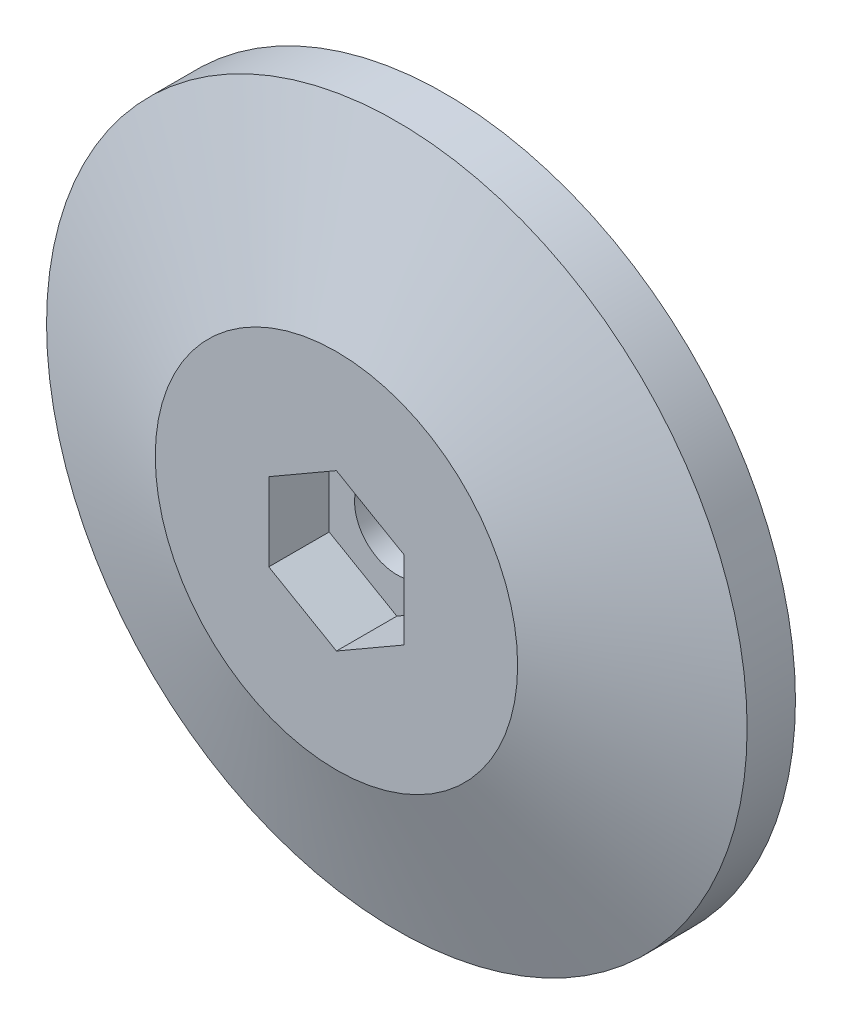
ISO-10303-21;
HEADER;
FILE_DESCRIPTION(('STEP AP214'),'2;1');
FILE_NAME('part.step','',(''),(''),'','','');
FILE_SCHEMA(('AUTOMOTIVE_DESIGN { 1 0 10303 214 1 1 1 1 }'));
ENDSEC;
DATA;
#1=APPLICATION_CONTEXT('core data for automotive mechanical design processes');
#2=APPLICATION_PROTOCOL_DEFINITION('international standard','automotive_design',2000,#1);
#3=PRODUCT_CONTEXT('',#1,'mechanical');
#4=PRODUCT('Part','Part','',(#3));
#5=PRODUCT_RELATED_PRODUCT_CATEGORY('part','',(#4));
#6=PRODUCT_DEFINITION_FORMATION('','',#4);
#7=PRODUCT_DEFINITION_CONTEXT('part definition',#1,'design');
#8=PRODUCT_DEFINITION('design','',#6,#7);
#9=PRODUCT_DEFINITION_SHAPE('','',#8);
#10=(LENGTH_UNIT() NAMED_UNIT(*) SI_UNIT(.MILLI.,.METRE.));
#11=(NAMED_UNIT(*) PLANE_ANGLE_UNIT() SI_UNIT($,.RADIAN.));
#12=(NAMED_UNIT(*) SI_UNIT($,.STERADIAN.) SOLID_ANGLE_UNIT());
#13=UNCERTAINTY_MEASURE_WITH_UNIT(LENGTH_MEASURE(1.E-05),#10,'distance_accuracy_value','');
#14=(GEOMETRIC_REPRESENTATION_CONTEXT(3) GLOBAL_UNCERTAINTY_ASSIGNED_CONTEXT((#13)) GLOBAL_UNIT_ASSIGNED_CONTEXT((#10,
#11,#12)) REPRESENTATION_CONTEXT('',''));
#15=CARTESIAN_POINT('',(0.,0.,0.));
#16=DIRECTION('',(0.,0.,1.));
#17=DIRECTION('',(1.,0.,0.));
#18=AXIS2_PLACEMENT_3D('',#15,#16,#17);
#19=CARTESIAN_POINT('',(0.,0.,2.));
#20=DIRECTION('',(0.,0.,-1.));
#21=DIRECTION('',(-1.,0.,0.));
#22=AXIS2_PLACEMENT_3D('',#19,#20,#21);
#23=CYLINDRICAL_SURFACE('',#22,14.5);
#24=CARTESIAN_POINT('',(0.,0.,2.));
#25=DIRECTION('',(0.,0.,-1.));
#26=DIRECTION('',(-1.,0.,0.));
#27=AXIS2_PLACEMENT_3D('',#24,#25,#26);
#28=CIRCLE('',#27,14.5);
#29=CARTESIAN_POINT('',(-14.5,0.,2.));
#30=VERTEX_POINT('',#29);
#31=EDGE_CURVE('E12',#30,#30,#28,.F.);
#32=ORIENTED_EDGE('',*,*,#31,.F.);
#33=EDGE_LOOP('',(#32));
#34=FACE_BOUND('',#33,.T.);
#35=CARTESIAN_POINT('',(0.,0.,0.));
#36=DIRECTION('',(0.,0.,1.));
#37=DIRECTION('',(1.,0.,0.));
#38=AXIS2_PLACEMENT_3D('',#35,#36,#37);
#39=CIRCLE('',#38,14.5);
#40=CARTESIAN_POINT('',(14.5,0.,0.));
#41=VERTEX_POINT('',#40);
#42=EDGE_CURVE('E45',#41,#41,#39,.T.);
#43=ORIENTED_EDGE('',*,*,#42,.T.);
#44=EDGE_LOOP('',(#43));
#45=FACE_BOUND('',#44,.T.);
#46=ADVANCED_FACE('F37',(#34,#45),#23,.T.);
#47=CARTESIAN_POINT('',(0.,0.,0.));
#48=DIRECTION('',(0.,0.,1.));
#49=DIRECTION('',(1.,0.,0.));
#50=AXIS2_PLACEMENT_3D('',#47,#48,#49);
#51=PLANE('',#50);
#52=CARTESIAN_POINT('',(0.,0.,0.));
#53=DIRECTION('',(0.,0.,1.));
#54=DIRECTION('',(1.,0.,0.));
#55=AXIS2_PLACEMENT_3D('',#52,#53,#54);
#56=CIRCLE('',#55,1.75);
#57=CARTESIAN_POINT('',(1.75,0.,0.));
#58=VERTEX_POINT('',#57);
#59=EDGE_CURVE('E181',#58,#58,#56,.T.);
#60=ORIENTED_EDGE('',*,*,#59,.T.);
#61=EDGE_LOOP('',(#60));
#62=FACE_BOUND('',#61,.T.);
#63=ORIENTED_EDGE('',*,*,#42,.F.);
#64=EDGE_LOOP('',(#63));
#65=FACE_BOUND('',#64,.T.);
#66=ADVANCED_FACE('F169',(#62,#65),#51,.F.);
#67=CARTESIAN_POINT('',(0.,0.,4.5));
#68=DIRECTION('',(0.,0.,1.));
#69=DIRECTION('',(1.,0.,0.));
#70=AXIS2_PLACEMENT_3D('',#67,#68,#69);
#71=PLANE('',#70);
#72=DIRECTION('',(0.866025403784439,0.5,0.));
#73=VECTOR('',#72,1.);
#74=CARTESIAN_POINT('',(0.,-3.2331615074619,4.5));
#75=LINE('',#74,#73);
#76=CARTESIAN_POINT('',(0.,-3.2331615074619,4.5));
#77=VERTEX_POINT('',#76);
#78=CARTESIAN_POINT('',(2.8,-1.61658075373095,4.5));
#79=VERTEX_POINT('',#78);
#80=EDGE_CURVE('E53',#77,#79,#75,.T.);
#81=ORIENTED_EDGE('',*,*,#80,.F.);
#82=DIRECTION('',(0.866025403784439,-0.5,0.));
#83=VECTOR('',#82,1.);
#84=CARTESIAN_POINT('',(-2.8,-1.61658075373095,4.5));
#85=LINE('',#84,#83);
#86=CARTESIAN_POINT('',(-2.8,-1.61658075373095,4.5));
#87=VERTEX_POINT('',#86);
#88=EDGE_CURVE('E136',#87,#77,#85,.T.);
#89=ORIENTED_EDGE('',*,*,#88,.F.);
#90=DIRECTION('',(0.,-1.,0.));
#91=VECTOR('',#90,1.);
#92=CARTESIAN_POINT('',(-2.8,1.61658075373095,4.5));
#93=LINE('',#92,#91);
#94=CARTESIAN_POINT('',(-2.8,1.61658075373095,4.5));
#95=VERTEX_POINT('',#94);
#96=EDGE_CURVE('E134',#95,#87,#93,.T.);
#97=ORIENTED_EDGE('',*,*,#96,.F.);
#98=DIRECTION('',(-0.866025403784439,-0.5,0.));
#99=VECTOR('',#98,1.);
#100=CARTESIAN_POINT('',(0.,3.2331615074619,4.5));
#101=LINE('',#100,#99);
#102=CARTESIAN_POINT('',(0.,3.2331615074619,4.5));
#103=VERTEX_POINT('',#102);
#104=EDGE_CURVE('E101',#103,#95,#101,.T.);
#105=ORIENTED_EDGE('',*,*,#104,.F.);
#106=DIRECTION('',(-0.866025403784439,0.5,0.));
#107=VECTOR('',#106,1.);
#108=CARTESIAN_POINT('',(2.8,1.61658075373095,4.5));
#109=LINE('',#108,#107);
#110=CARTESIAN_POINT('',(2.8,1.61658075373095,4.5));
#111=VERTEX_POINT('',#110);
#112=EDGE_CURVE('E130',#111,#103,#109,.T.);
#113=ORIENTED_EDGE('',*,*,#112,.F.);
#114=DIRECTION('',(0.,1.,0.));
#115=VECTOR('',#114,1.);
#116=CARTESIAN_POINT('',(2.8,-1.61658075373095,4.5));
#117=LINE('',#116,#115);
#118=EDGE_CURVE('E127',#79,#111,#117,.T.);
#119=ORIENTED_EDGE('',*,*,#118,.F.);
#120=EDGE_LOOP('',(#81,#89,#97,#105,#113,#119));
#121=FACE_BOUND('',#120,.T.);
#122=CARTESIAN_POINT('',(0.,0.,4.5));
#123=DIRECTION('',(0.,0.,1.));
#124=DIRECTION('',(1.,0.,0.));
#125=AXIS2_PLACEMENT_3D('',#122,#123,#124);
#126=CIRCLE('',#125,7.5);
#127=CARTESIAN_POINT('',(7.5,0.,4.5));
#128=VERTEX_POINT('',#127);
#129=EDGE_CURVE('E140',#128,#128,#126,.T.);
#130=ORIENTED_EDGE('',*,*,#129,.T.);
#131=EDGE_LOOP('',(#130));
#132=FACE_BOUND('',#131,.T.);
#133=ADVANCED_FACE('F165',(#121,#132),#71,.T.);
#134=CARTESIAN_POINT('',(0.,0.,4.5));
#135=DIRECTION('',(0.,0.,-1.));
#136=DIRECTION('',(-1.,0.,0.));
#137=AXIS2_PLACEMENT_3D('',#134,#135,#136);
#138=CONICAL_SURFACE('',#137,7.5,1.22777238637419);
#139=ORIENTED_EDGE('',*,*,#31,.T.);
#140=EDGE_LOOP('',(#139));
#141=FACE_BOUND('',#140,.T.);
#142=ORIENTED_EDGE('',*,*,#129,.F.);
#143=EDGE_LOOP('',(#142));
#144=FACE_BOUND('',#143,.T.);
#145=ADVANCED_FACE('F155',(#141,#144),#138,.T.);
#146=CARTESIAN_POINT('',(0.,-3.2331615074619,2.));
#147=DIRECTION('',(0.5,-0.866025403784439,0.));
#148=DIRECTION('',(0.866025403784439,0.5,0.));
#149=AXIS2_PLACEMENT_3D('',#146,#147,#148);
#150=PLANE('',#149);
#151=ORIENTED_EDGE('',*,*,#80,.T.);
#152=DIRECTION('',(0.,0.,1.));
#153=VECTOR('',#152,1.);
#154=CARTESIAN_POINT('',(2.8,-1.61658075373095,2.));
#155=LINE('',#154,#153);
#156=CARTESIAN_POINT('',(2.8,-1.61658075373095,2.));
#157=VERTEX_POINT('',#156);
#158=EDGE_CURVE('E83',#157,#79,#155,.T.);
#159=ORIENTED_EDGE('',*,*,#158,.F.);
#160=DIRECTION('',(0.866025403784439,0.5,0.));
#161=VECTOR('',#160,1.);
#162=CARTESIAN_POINT('',(0.,-3.2331615074619,2.));
#163=LINE('',#162,#161);
#164=CARTESIAN_POINT('',(0.,-3.2331615074619,2.));
#165=VERTEX_POINT('',#164);
#166=EDGE_CURVE('E138',#165,#157,#163,.T.);
#167=ORIENTED_EDGE('',*,*,#166,.F.);
#168=DIRECTION('',(0.,0.,1.));
#169=VECTOR('',#168,1.);
#170=CARTESIAN_POINT('',(0.,-3.2331615074619,2.));
#171=LINE('',#170,#169);
#172=EDGE_CURVE('E61',#165,#77,#171,.T.);
#173=ORIENTED_EDGE('',*,*,#172,.T.);
#174=EDGE_LOOP('',(#151,#159,#167,#173));
#175=FACE_BOUND('',#174,.T.);
#176=ADVANCED_FACE('F164',(#175),#150,.F.);
#177=CARTESIAN_POINT('',(-2.8,-1.61658075373095,2.));
#178=DIRECTION('',(-0.5,-0.866025403784439,0.));
#179=DIRECTION('',(0.866025403784439,-0.5,0.));
#180=AXIS2_PLACEMENT_3D('',#177,#178,#179);
#181=PLANE('',#180);
#182=ORIENTED_EDGE('',*,*,#88,.T.);
#183=ORIENTED_EDGE('',*,*,#172,.F.);
#184=DIRECTION('',(0.866025403784439,-0.5,0.));
#185=VECTOR('',#184,1.);
#186=CARTESIAN_POINT('',(-2.8,-1.61658075373095,2.));
#187=LINE('',#186,#185);
#188=CARTESIAN_POINT('',(-2.8,-1.61658075373095,2.));
#189=VERTEX_POINT('',#188);
#190=EDGE_CURVE('E113',#189,#165,#187,.T.);
#191=ORIENTED_EDGE('',*,*,#190,.F.);
#192=DIRECTION('',(0.,0.,1.));
#193=VECTOR('',#192,1.);
#194=CARTESIAN_POINT('',(-2.8,-1.61658075373095,2.));
#195=LINE('',#194,#193);
#196=EDGE_CURVE('E105',#189,#87,#195,.T.);
#197=ORIENTED_EDGE('',*,*,#196,.T.);
#198=EDGE_LOOP('',(#182,#183,#191,#197));
#199=FACE_BOUND('',#198,.T.);
#200=ADVANCED_FACE('F209',(#199),#181,.F.);
#201=CARTESIAN_POINT('',(-2.8,1.61658075373095,2.));
#202=DIRECTION('',(-1.,0.,0.));
#203=DIRECTION('',(0.,-1.,0.));
#204=AXIS2_PLACEMENT_3D('',#201,#202,#203);
#205=PLANE('',#204);
#206=ORIENTED_EDGE('',*,*,#96,.T.);
#207=ORIENTED_EDGE('',*,*,#196,.F.);
#208=DIRECTION('',(0.,-1.,0.));
#209=VECTOR('',#208,1.);
#210=CARTESIAN_POINT('',(-2.8,1.61658075373095,2.));
#211=LINE('',#210,#209);
#212=CARTESIAN_POINT('',(-2.8,1.61658075373095,2.));
#213=VERTEX_POINT('',#212);
#214=EDGE_CURVE('E109',#213,#189,#211,.T.);
#215=ORIENTED_EDGE('',*,*,#214,.F.);
#216=DIRECTION('',(0.,0.,1.));
#217=VECTOR('',#216,1.);
#218=CARTESIAN_POINT('',(-2.8,1.61658075373095,2.));
#219=LINE('',#218,#217);
#220=EDGE_CURVE('E94',#213,#95,#219,.T.);
#221=ORIENTED_EDGE('',*,*,#220,.T.);
#222=EDGE_LOOP('',(#206,#207,#215,#221));
#223=FACE_BOUND('',#222,.T.);
#224=ADVANCED_FACE('F110',(#223),#205,.F.);
#225=CARTESIAN_POINT('',(0.,3.2331615074619,2.));
#226=DIRECTION('',(-0.5,0.866025403784438,0.));
#227=DIRECTION('',(-0.866025403784438,-0.5,0.));
#228=AXIS2_PLACEMENT_3D('',#225,#226,#227);
#229=PLANE('',#228);
#230=ORIENTED_EDGE('',*,*,#104,.T.);
#231=ORIENTED_EDGE('',*,*,#220,.F.);
#232=DIRECTION('',(-0.866025403784439,-0.5,0.));
#233=VECTOR('',#232,1.);
#234=CARTESIAN_POINT('',(0.,3.2331615074619,2.));
#235=LINE('',#234,#233);
#236=CARTESIAN_POINT('',(0.,3.2331615074619,2.));
#237=VERTEX_POINT('',#236);
#238=EDGE_CURVE('E98',#237,#213,#235,.T.);
#239=ORIENTED_EDGE('',*,*,#238,.F.);
#240=DIRECTION('',(0.,0.,1.));
#241=VECTOR('',#240,1.);
#242=CARTESIAN_POINT('',(0.,3.2331615074619,2.));
#243=LINE('',#242,#241);
#244=EDGE_CURVE('E106',#237,#103,#243,.T.);
#245=ORIENTED_EDGE('',*,*,#244,.T.);
#246=EDGE_LOOP('',(#230,#231,#239,#245));
#247=FACE_BOUND('',#246,.T.);
#248=ADVANCED_FACE('F96',(#247),#229,.F.);
#249=CARTESIAN_POINT('',(2.8,1.61658075373095,2.));
#250=DIRECTION('',(0.5,0.866025403784439,0.));
#251=DIRECTION('',(-0.866025403784439,0.5,0.));
#252=AXIS2_PLACEMENT_3D('',#249,#250,#251);
#253=PLANE('',#252);
#254=ORIENTED_EDGE('',*,*,#112,.T.);
#255=ORIENTED_EDGE('',*,*,#244,.F.);
#256=DIRECTION('',(-0.866025403784439,0.5,0.));
#257=VECTOR('',#256,1.);
#258=CARTESIAN_POINT('',(2.8,1.61658075373095,2.));
#259=LINE('',#258,#257);
#260=CARTESIAN_POINT('',(2.8,1.61658075373095,2.));
#261=VERTEX_POINT('',#260);
#262=EDGE_CURVE('E119',#261,#237,#259,.T.);
#263=ORIENTED_EDGE('',*,*,#262,.F.);
#264=DIRECTION('',(0.,0.,1.));
#265=VECTOR('',#264,1.);
#266=CARTESIAN_POINT('',(2.8,1.61658075373095,2.));
#267=LINE('',#266,#265);
#268=EDGE_CURVE('E143',#261,#111,#267,.T.);
#269=ORIENTED_EDGE('',*,*,#268,.T.);
#270=EDGE_LOOP('',(#254,#255,#263,#269));
#271=FACE_BOUND('',#270,.T.);
#272=ADVANCED_FACE('F207',(#271),#253,.F.);
#273=CARTESIAN_POINT('',(2.8,-1.61658075373095,2.));
#274=DIRECTION('',(1.,0.,0.));
#275=DIRECTION('',(0.,1.,0.));
#276=AXIS2_PLACEMENT_3D('',#273,#274,#275);
#277=PLANE('',#276);
#278=ORIENTED_EDGE('',*,*,#118,.T.);
#279=ORIENTED_EDGE('',*,*,#268,.F.);
#280=DIRECTION('',(0.,1.,0.));
#281=VECTOR('',#280,1.);
#282=CARTESIAN_POINT('',(2.8,-1.61658075373095,2.));
#283=LINE('',#282,#281);
#284=EDGE_CURVE('E121',#157,#261,#283,.T.);
#285=ORIENTED_EDGE('',*,*,#284,.F.);
#286=ORIENTED_EDGE('',*,*,#158,.T.);
#287=EDGE_LOOP('',(#278,#279,#285,#286));
#288=FACE_BOUND('',#287,.T.);
#289=ADVANCED_FACE('F203',(#288),#277,.F.);
#290=CARTESIAN_POINT('',(0.,0.,2.));
#291=DIRECTION('',(0.,0.,1.));
#292=DIRECTION('',(1.,0.,0.));
#293=AXIS2_PLACEMENT_3D('',#290,#291,#292);
#294=PLANE('',#293);
#295=CARTESIAN_POINT('',(0.,0.,2.));
#296=DIRECTION('',(0.,0.,1.));
#297=DIRECTION('',(1.,0.,0.));
#298=AXIS2_PLACEMENT_3D('',#295,#296,#297);
#299=CIRCLE('',#298,1.75);
#300=CARTESIAN_POINT('',(1.75,0.,2.));
#301=VERTEX_POINT('',#300);
#302=EDGE_CURVE('E40',#301,#301,#299,.F.);
#303=ORIENTED_EDGE('',*,*,#302,.T.);
#304=EDGE_LOOP('',(#303));
#305=FACE_BOUND('',#304,.T.);
#306=ORIENTED_EDGE('',*,*,#166,.T.);
#307=ORIENTED_EDGE('',*,*,#284,.T.);
#308=ORIENTED_EDGE('',*,*,#262,.T.);
#309=ORIENTED_EDGE('',*,*,#238,.T.);
#310=ORIENTED_EDGE('',*,*,#214,.T.);
#311=ORIENTED_EDGE('',*,*,#190,.T.);
#312=EDGE_LOOP('',(#306,#307,#308,#309,#310,#311));
#313=FACE_BOUND('',#312,.T.);
#314=ADVANCED_FACE('F116',(#305,#313),#294,.T.);
#315=CARTESIAN_POINT('',(0.,0.,2.8));
#316=DIRECTION('',(0.,0.,-1.));
#317=DIRECTION('',(-1.,0.,0.));
#318=AXIS2_PLACEMENT_3D('',#315,#316,#317);
#319=CYLINDRICAL_SURFACE('',#318,1.75);
#320=ORIENTED_EDGE('',*,*,#302,.F.);
#321=EDGE_LOOP('',(#320));
#322=FACE_BOUND('',#321,.T.);
#323=ORIENTED_EDGE('',*,*,#59,.F.);
#324=EDGE_LOOP('',(#323));
#325=FACE_BOUND('',#324,.T.);
#326=ADVANCED_FACE('F228',(#322,#325),#319,.F.);
#327=CLOSED_SHELL('',(#46,#66,#133,#145,#176,#200,#224,#248,#272,#289,#314,#326));
#328=MANIFOLD_SOLID_BREP('B2',#327);
#329=ADVANCED_BREP_SHAPE_REPRESENTATION('',(#18,#328),#14);
#330=SHAPE_DEFINITION_REPRESENTATION(#9,#329);
ENDSEC;
END-ISO-10303-21;
